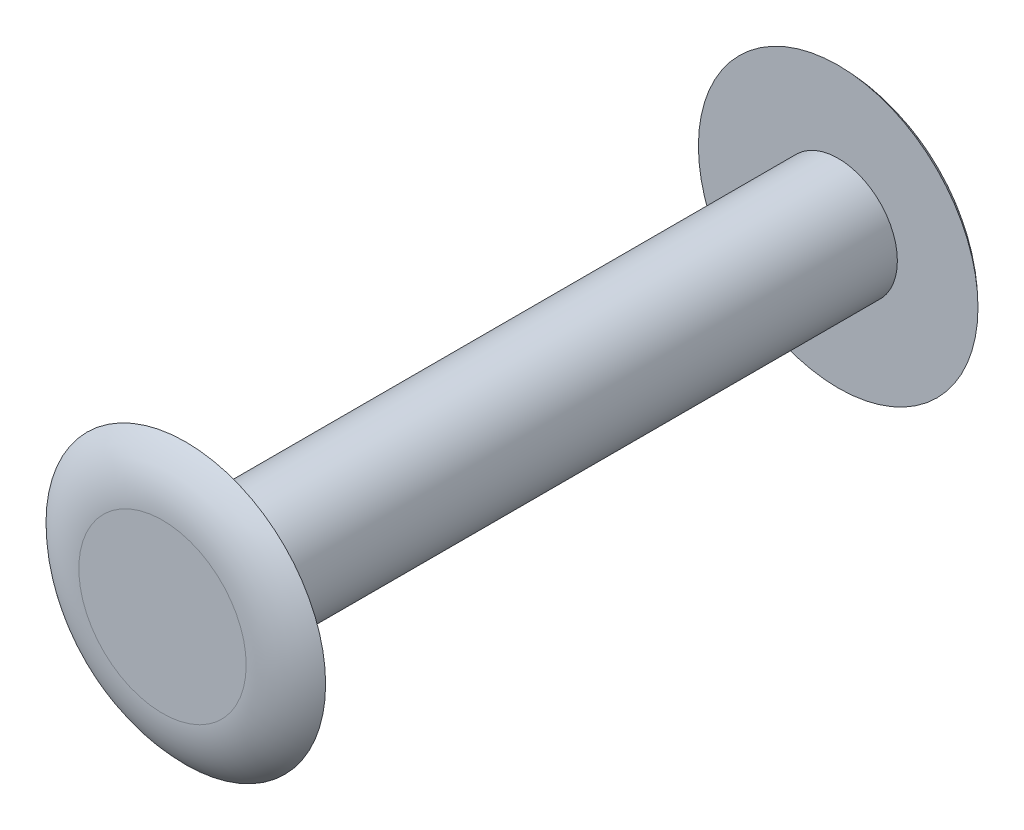
ISO-10303-21;
HEADER;
FILE_DESCRIPTION(('STEP AP214'),'2;1');
FILE_NAME('part.step','',(''),(''),'','','');
FILE_SCHEMA(('AUTOMOTIVE_DESIGN { 1 0 10303 214 1 1 1 1 }'));
ENDSEC;
DATA;
#1=APPLICATION_CONTEXT('core data for automotive mechanical design processes');
#2=APPLICATION_PROTOCOL_DEFINITION('international standard','automotive_design',2000,#1);
#3=PRODUCT_CONTEXT('',#1,'mechanical');
#4=PRODUCT('Part','Part','',(#3));
#5=PRODUCT_RELATED_PRODUCT_CATEGORY('part','',(#4));
#6=PRODUCT_DEFINITION_FORMATION('','',#4);
#7=PRODUCT_DEFINITION_CONTEXT('part definition',#1,'design');
#8=PRODUCT_DEFINITION('design','',#6,#7);
#9=PRODUCT_DEFINITION_SHAPE('','',#8);
#10=(LENGTH_UNIT() NAMED_UNIT(*) SI_UNIT(.MILLI.,.METRE.));
#11=(NAMED_UNIT(*) PLANE_ANGLE_UNIT() SI_UNIT($,.RADIAN.));
#12=(NAMED_UNIT(*) SI_UNIT($,.STERADIAN.) SOLID_ANGLE_UNIT());
#13=UNCERTAINTY_MEASURE_WITH_UNIT(LENGTH_MEASURE(1.E-05),#10,'distance_accuracy_value','');
#14=(GEOMETRIC_REPRESENTATION_CONTEXT(3) GLOBAL_UNCERTAINTY_ASSIGNED_CONTEXT((#13)) GLOBAL_UNIT_ASSIGNED_CONTEXT((#10,
#11,#12)) REPRESENTATION_CONTEXT('',''));
#15=CARTESIAN_POINT('',(0.,0.,0.));
#16=DIRECTION('',(0.,0.,1.));
#17=DIRECTION('',(1.,0.,0.));
#18=AXIS2_PLACEMENT_3D('',#15,#16,#17);
#19=CARTESIAN_POINT('',(0.,0.,70.));
#20=DIRECTION('',(0.,0.,-1.));
#21=DIRECTION('',(-1.,0.,0.));
#22=AXIS2_PLACEMENT_3D('',#19,#20,#21);
#23=CYLINDRICAL_SURFACE('',#22,6.35);
#24=CARTESIAN_POINT('',(0.,0.,70.));
#25=DIRECTION('',(0.,0.,1.));
#26=DIRECTION('',(1.,0.,0.));
#27=AXIS2_PLACEMENT_3D('',#24,#25,#26);
#28=CIRCLE('',#27,6.35);
#29=CARTESIAN_POINT('',(6.35,0.,70.));
#30=VERTEX_POINT('',#29);
#31=EDGE_CURVE('E54',#30,#30,#28,.T.);
#32=ORIENTED_EDGE('',*,*,#31,.F.);
#33=EDGE_LOOP('',(#32));
#34=FACE_BOUND('',#33,.T.);
#35=CARTESIAN_POINT('',(0.,0.,0.));
#36=DIRECTION('',(0.,0.,1.));
#37=DIRECTION('',(1.,0.,0.));
#38=AXIS2_PLACEMENT_3D('',#35,#36,#37);
#39=CIRCLE('',#38,6.35);
#40=CARTESIAN_POINT('',(6.35,0.,0.));
#41=VERTEX_POINT('',#40);
#42=EDGE_CURVE('E59',#41,#41,#39,.T.);
#43=ORIENTED_EDGE('',*,*,#42,.T.);
#44=EDGE_LOOP('',(#43));
#45=FACE_BOUND('',#44,.T.);
#46=ADVANCED_FACE('F41',(#34,#45),#23,.T.);
#47=CARTESIAN_POINT('',(0.,0.,-2.5));
#48=DIRECTION('',(0.,0.,-1.));
#49=DIRECTION('',(-1.,0.,0.));
#50=AXIS2_PLACEMENT_3D('',#47,#48,#49);
#51=PLANE('',#50);
#52=CARTESIAN_POINT('',(0.,0.,-2.5));
#53=DIRECTION('',(0.,0.,-1.));
#54=DIRECTION('',(-1.,0.,0.));
#55=AXIS2_PLACEMENT_3D('',#52,#53,#54);
#56=CIRCLE('',#55,8.97920271060385);
#57=CARTESIAN_POINT('',(-8.97920271060385,0.,-2.5));
#58=VERTEX_POINT('',#57);
#59=EDGE_CURVE('E49',#58,#58,#56,.T.);
#60=ORIENTED_EDGE('',*,*,#59,.T.);
#61=EDGE_LOOP('',(#60));
#62=FACE_BOUND('',#61,.T.);
#63=ADVANCED_FACE('F91',(#62),#51,.T.);
#64=CARTESIAN_POINT('',(0.,0.,0.));
#65=DIRECTION('',(0.,0.,-1.));
#66=DIRECTION('',(-1.,0.,0.));
#67=AXIS2_PLACEMENT_3D('',#64,#65,#66);
#68=PLANE('',#67);
#69=ORIENTED_EDGE('',*,*,#42,.F.);
#70=EDGE_LOOP('',(#69));
#71=FACE_BOUND('',#70,.T.);
#72=CARTESIAN_POINT('',(0.,0.,0.));
#73=DIRECTION('',(0.,0.,-1.));
#74=DIRECTION('',(-1.,0.,0.));
#75=AXIS2_PLACEMENT_3D('',#72,#73,#74);
#76=CIRCLE('',#75,15.);
#77=CARTESIAN_POINT('',(-15.,0.,0.));
#78=VERTEX_POINT('',#77);
#79=EDGE_CURVE('E64',#78,#78,#76,.T.);
#80=ORIENTED_EDGE('',*,*,#79,.F.);
#81=EDGE_LOOP('',(#80));
#82=FACE_BOUND('',#81,.T.);
#83=ADVANCED_FACE('F87',(#71,#82),#68,.F.);
#84=CARTESIAN_POINT('',(0.,0.,72.5));
#85=DIRECTION('',(0.,0.,1.));
#86=DIRECTION('',(1.,0.,0.));
#87=AXIS2_PLACEMENT_3D('',#84,#85,#86);
#88=PLANE('',#87);
#89=CARTESIAN_POINT('',(0.,0.,72.5));
#90=DIRECTION('',(0.,0.,1.));
#91=DIRECTION('',(1.,0.,0.));
#92=AXIS2_PLACEMENT_3D('',#89,#90,#91);
#93=CIRCLE('',#92,8.97920271060386);
#94=CARTESIAN_POINT('',(8.97920271060386,0.,72.5));
#95=VERTEX_POINT('',#94);
#96=EDGE_CURVE('E10',#95,#95,#93,.T.);
#97=ORIENTED_EDGE('',*,*,#96,.T.);
#98=EDGE_LOOP('',(#97));
#99=FACE_BOUND('',#98,.T.);
#100=ADVANCED_FACE('F79',(#99),#88,.T.);
#101=CARTESIAN_POINT('',(0.,0.,70.));
#102=DIRECTION('',(0.,0.,1.));
#103=DIRECTION('',(1.,0.,0.));
#104=AXIS2_PLACEMENT_3D('',#101,#102,#103);
#105=PLANE('',#104);
#106=ORIENTED_EDGE('',*,*,#31,.T.);
#107=EDGE_LOOP('',(#106));
#108=FACE_BOUND('',#107,.T.);
#109=CARTESIAN_POINT('',(0.,0.,70.));
#110=DIRECTION('',(0.,0.,1.));
#111=DIRECTION('',(1.,0.,0.));
#112=AXIS2_PLACEMENT_3D('',#109,#110,#111);
#113=CIRCLE('',#112,15.);
#114=CARTESIAN_POINT('',(15.,0.,70.));
#115=VERTEX_POINT('',#114);
#116=EDGE_CURVE('E69',#115,#115,#113,.T.);
#117=ORIENTED_EDGE('',*,*,#116,.F.);
#118=EDGE_LOOP('',(#117));
#119=FACE_BOUND('',#118,.T.);
#120=ADVANCED_FACE('F76',(#108,#119),#105,.F.);
#121=CARTESIAN_POINT('',(0.,0.,6.));
#122=DIRECTION('',(0.,0.,1.));
#123=DIRECTION('',(1.,0.,0.));
#124=AXIS2_PLACEMENT_3D('',#121,#122,#123);
#125=TOROIDAL_SURFACE('',#124,8.97920271060385,8.5);
#126=ORIENTED_EDGE('',*,*,#79,.T.);
#127=EDGE_LOOP('',(#126));
#128=FACE_BOUND('',#127,.T.);
#129=ORIENTED_EDGE('',*,*,#59,.F.);
#130=EDGE_LOOP('',(#129));
#131=FACE_BOUND('',#130,.T.);
#132=ADVANCED_FACE('F78',(#128,#131),#125,.T.);
#133=CARTESIAN_POINT('',(0.,0.,64.));
#134=DIRECTION('',(0.,0.,-1.));
#135=DIRECTION('',(-1.,0.,0.));
#136=AXIS2_PLACEMENT_3D('',#133,#134,#135);
#137=TOROIDAL_SURFACE('',#136,8.97920271060386,8.5);
#138=ORIENTED_EDGE('',*,*,#116,.T.);
#139=EDGE_LOOP('',(#138));
#140=FACE_BOUND('',#139,.T.);
#141=ORIENTED_EDGE('',*,*,#96,.F.);
#142=EDGE_LOOP('',(#141));
#143=FACE_BOUND('',#142,.T.);
#144=ADVANCED_FACE('F43',(#140,#143),#137,.T.);
#145=CLOSED_SHELL('',(#46,#63,#83,#100,#120,#132,#144));
#146=MANIFOLD_SOLID_BREP('B2',#145);
#147=ADVANCED_BREP_SHAPE_REPRESENTATION('',(#18,#146),#14);
#148=SHAPE_DEFINITION_REPRESENTATION(#9,#147);
ENDSEC;
END-ISO-10303-21;
